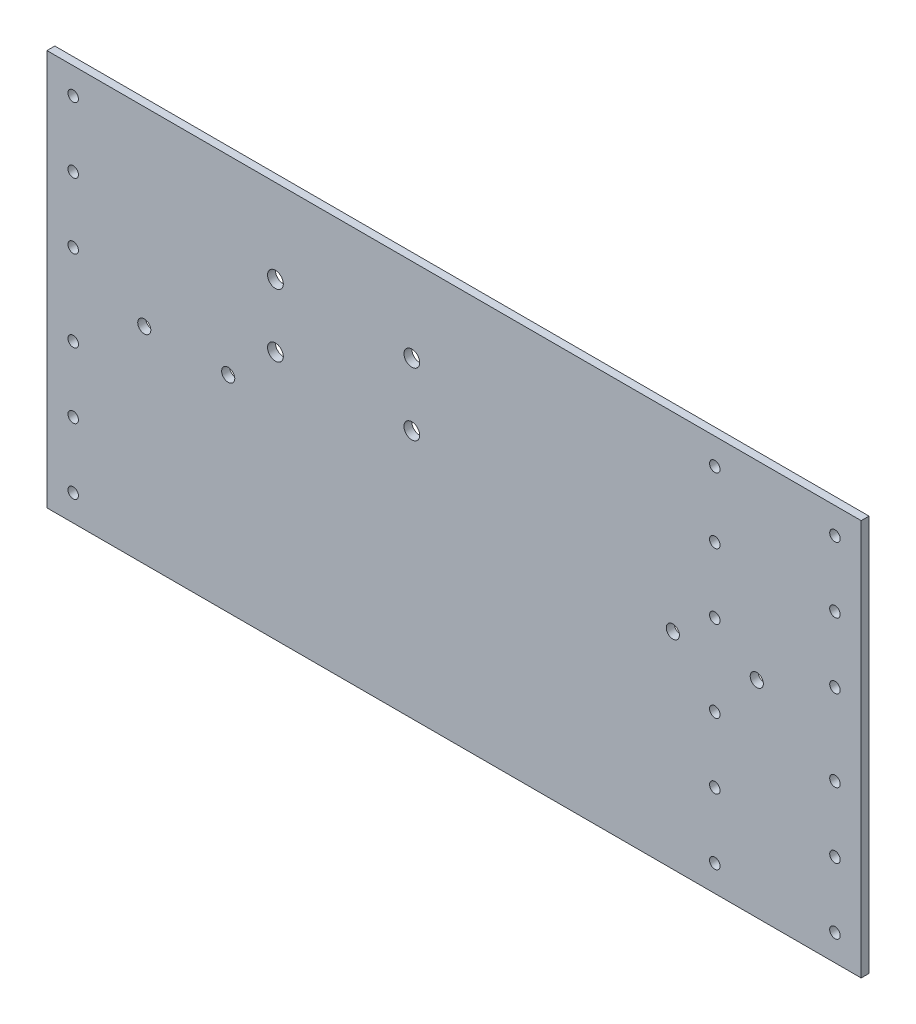
ISO-10303-21;
HEADER;
FILE_DESCRIPTION(('STEP AP214'),'2;1');
FILE_NAME('part.step','',(''),(''),'','','');
FILE_SCHEMA(('AUTOMOTIVE_DESIGN { 1 0 10303 214 1 1 1 1 }'));
ENDSEC;
DATA;
#1=APPLICATION_CONTEXT('core data for automotive mechanical design processes');
#2=APPLICATION_PROTOCOL_DEFINITION('international standard','automotive_design',2000,#1);
#3=PRODUCT_CONTEXT('',#1,'mechanical');
#4=PRODUCT('Part','Part','',(#3));
#5=PRODUCT_RELATED_PRODUCT_CATEGORY('part','',(#4));
#6=PRODUCT_DEFINITION_FORMATION('','',#4);
#7=PRODUCT_DEFINITION_CONTEXT('part definition',#1,'design');
#8=PRODUCT_DEFINITION('design','',#6,#7);
#9=PRODUCT_DEFINITION_SHAPE('','',#8);
#10=(LENGTH_UNIT() NAMED_UNIT(*) SI_UNIT(.MILLI.,.METRE.));
#11=(NAMED_UNIT(*) PLANE_ANGLE_UNIT() SI_UNIT($,.RADIAN.));
#12=(NAMED_UNIT(*) SI_UNIT($,.STERADIAN.) SOLID_ANGLE_UNIT());
#13=UNCERTAINTY_MEASURE_WITH_UNIT(LENGTH_MEASURE(1.E-05),#10,'distance_accuracy_value','');
#14=(GEOMETRIC_REPRESENTATION_CONTEXT(3) GLOBAL_UNCERTAINTY_ASSIGNED_CONTEXT((#13)) GLOBAL_UNIT_ASSIGNED_CONTEXT((#10,
#11,#12)) REPRESENTATION_CONTEXT('',''));
#15=CARTESIAN_POINT('',(0.,0.,0.));
#16=DIRECTION('',(0.,0.,1.));
#17=DIRECTION('',(1.,0.,0.));
#18=AXIS2_PLACEMENT_3D('',#15,#16,#17);
#19=CARTESIAN_POINT('',(0.,0.,3.));
#20=DIRECTION('',(1.,0.,0.));
#21=DIRECTION('',(0.,0.,-1.));
#22=AXIS2_PLACEMENT_3D('',#19,#20,#21);
#23=PLANE('',#22);
#24=DIRECTION('',(0.,-1.,0.));
#25=VECTOR('',#24,1.);
#26=CARTESIAN_POINT('',(0.,0.,0.));
#27=LINE('',#26,#25);
#28=CARTESIAN_POINT('',(0.,151.,0.));
#29=VERTEX_POINT('',#28);
#30=CARTESIAN_POINT('',(0.,0.,0.));
#31=VERTEX_POINT('',#30);
#32=EDGE_CURVE('E95',#29,#31,#27,.T.);
#33=ORIENTED_EDGE('',*,*,#32,.T.);
#34=DIRECTION('',(0.,0.,-1.));
#35=VECTOR('',#34,1.);
#36=CARTESIAN_POINT('',(0.,0.,3.));
#37=LINE('',#36,#35);
#38=CARTESIAN_POINT('',(0.,0.,3.));
#39=VERTEX_POINT('',#38);
#40=EDGE_CURVE('E11',#39,#31,#37,.T.);
#41=ORIENTED_EDGE('',*,*,#40,.F.);
#42=DIRECTION('',(0.,-1.,0.));
#43=VECTOR('',#42,1.);
#44=CARTESIAN_POINT('',(0.,0.,3.));
#45=LINE('',#44,#43);
#46=CARTESIAN_POINT('',(0.,151.,3.));
#47=VERTEX_POINT('',#46);
#48=EDGE_CURVE('E83',#47,#39,#45,.T.);
#49=ORIENTED_EDGE('',*,*,#48,.F.);
#50=DIRECTION('',(0.,0.,-1.));
#51=VECTOR('',#50,1.);
#52=CARTESIAN_POINT('',(0.,151.,3.));
#53=LINE('',#52,#51);
#54=EDGE_CURVE('E91',#47,#29,#53,.T.);
#55=ORIENTED_EDGE('',*,*,#54,.T.);
#56=EDGE_LOOP('',(#33,#41,#49,#55));
#57=FACE_BOUND('',#56,.T.);
#58=ADVANCED_FACE('F32',(#57),#23,.F.);
#59=CARTESIAN_POINT('',(0.,0.,3.));
#60=DIRECTION('',(0.,1.,0.));
#61=DIRECTION('',(0.,0.,1.));
#62=AXIS2_PLACEMENT_3D('',#59,#60,#61);
#63=PLANE('',#62);
#64=DIRECTION('',(1.,0.,0.));
#65=VECTOR('',#64,1.);
#66=CARTESIAN_POINT('',(0.,0.,0.));
#67=LINE('',#66,#65);
#68=CARTESIAN_POINT('',(310.4,0.,0.));
#69=VERTEX_POINT('',#68);
#70=EDGE_CURVE('E87',#31,#69,#67,.T.);
#71=ORIENTED_EDGE('',*,*,#70,.T.);
#72=DIRECTION('',(0.,0.,-1.));
#73=VECTOR('',#72,1.);
#74=CARTESIAN_POINT('',(310.4,0.,3.));
#75=LINE('',#74,#73);
#76=CARTESIAN_POINT('',(310.4,0.,3.));
#77=VERTEX_POINT('',#76);
#78=EDGE_CURVE('E40',#77,#69,#75,.T.);
#79=ORIENTED_EDGE('',*,*,#78,.F.);
#80=DIRECTION('',(1.,0.,0.));
#81=VECTOR('',#80,1.);
#82=CARTESIAN_POINT('',(0.,0.,3.));
#83=LINE('',#82,#81);
#84=EDGE_CURVE('E78',#39,#77,#83,.T.);
#85=ORIENTED_EDGE('',*,*,#84,.F.);
#86=ORIENTED_EDGE('',*,*,#40,.T.);
#87=EDGE_LOOP('',(#71,#79,#85,#86));
#88=FACE_BOUND('',#87,.T.);
#89=ADVANCED_FACE('F86',(#88),#63,.F.);
#90=CARTESIAN_POINT('',(310.4,0.,3.));
#91=DIRECTION('',(-1.,0.,0.));
#92=DIRECTION('',(0.,-1.,0.));
#93=AXIS2_PLACEMENT_3D('',#90,#91,#92);
#94=PLANE('',#93);
#95=DIRECTION('',(0.,1.,0.));
#96=VECTOR('',#95,1.);
#97=CARTESIAN_POINT('',(310.4,0.,0.));
#98=LINE('',#97,#96);
#99=CARTESIAN_POINT('',(310.4,151.,0.));
#100=VERTEX_POINT('',#99);
#101=EDGE_CURVE('E65',#69,#100,#98,.T.);
#102=ORIENTED_EDGE('',*,*,#101,.T.);
#103=DIRECTION('',(0.,0.,-1.));
#104=VECTOR('',#103,1.);
#105=CARTESIAN_POINT('',(310.4,151.,3.));
#106=LINE('',#105,#104);
#107=CARTESIAN_POINT('',(310.4,151.,3.));
#108=VERTEX_POINT('',#107);
#109=EDGE_CURVE('E88',#108,#100,#106,.T.);
#110=ORIENTED_EDGE('',*,*,#109,.F.);
#111=DIRECTION('',(0.,1.,0.));
#112=VECTOR('',#111,1.);
#113=CARTESIAN_POINT('',(310.4,0.,3.));
#114=LINE('',#113,#112);
#115=EDGE_CURVE('E81',#77,#108,#114,.T.);
#116=ORIENTED_EDGE('',*,*,#115,.F.);
#117=ORIENTED_EDGE('',*,*,#78,.T.);
#118=EDGE_LOOP('',(#102,#110,#116,#117));
#119=FACE_BOUND('',#118,.T.);
#120=ADVANCED_FACE('F89',(#119),#94,.F.);
#121=CARTESIAN_POINT('',(0.,151.,3.));
#122=DIRECTION('',(0.,-1.,0.));
#123=DIRECTION('',(0.,0.,-1.));
#124=AXIS2_PLACEMENT_3D('',#121,#122,#123);
#125=PLANE('',#124);
#126=DIRECTION('',(-1.,0.,0.));
#127=VECTOR('',#126,1.);
#128=CARTESIAN_POINT('',(0.,151.,0.));
#129=LINE('',#128,#127);
#130=EDGE_CURVE('E71',#100,#29,#129,.T.);
#131=ORIENTED_EDGE('',*,*,#130,.T.);
#132=ORIENTED_EDGE('',*,*,#54,.F.);
#133=DIRECTION('',(-1.,0.,0.));
#134=VECTOR('',#133,1.);
#135=CARTESIAN_POINT('',(0.,151.,3.));
#136=LINE('',#135,#134);
#137=EDGE_CURVE('E48',#108,#47,#136,.T.);
#138=ORIENTED_EDGE('',*,*,#137,.F.);
#139=ORIENTED_EDGE('',*,*,#109,.T.);
#140=EDGE_LOOP('',(#131,#132,#138,#139));
#141=FACE_BOUND('',#140,.T.);
#142=ADVANCED_FACE('F103',(#141),#125,.F.);
#143=CARTESIAN_POINT('',(0.,0.,3.));
#144=DIRECTION('',(0.,0.,-1.));
#145=DIRECTION('',(-1.,0.,0.));
#146=AXIS2_PLACEMENT_3D('',#143,#144,#145);
#147=PLANE('',#146);
#148=CARTESIAN_POINT('',(37.1,78.5,3.));
#149=DIRECTION('',(0.,0.,-1.));
#150=DIRECTION('',(-1.,0.,0.));
#151=AXIS2_PLACEMENT_3D('',#148,#149,#150);
#152=CIRCLE('',#151,2.5);
#153=CARTESIAN_POINT('',(34.6,78.5,3.));
#154=VERTEX_POINT('',#153);
#155=EDGE_CURVE('E258',#154,#154,#152,.T.);
#156=ORIENTED_EDGE('',*,*,#155,.T.);
#157=EDGE_LOOP('',(#156));
#158=FACE_BOUND('',#157,.T.);
#159=CARTESIAN_POINT('',(69.1,78.5,3.));
#160=DIRECTION('',(0.,0.,-1.));
#161=DIRECTION('',(-1.,0.,0.));
#162=AXIS2_PLACEMENT_3D('',#159,#160,#161);
#163=CIRCLE('',#162,2.50000000000001);
#164=CARTESIAN_POINT('',(66.6,78.5,3.));
#165=VERTEX_POINT('',#164);
#166=EDGE_CURVE('E252',#165,#165,#163,.T.);
#167=ORIENTED_EDGE('',*,*,#166,.T.);
#168=EDGE_LOOP('',(#167));
#169=FACE_BOUND('',#168,.T.);
#170=CARTESIAN_POINT('',(238.6,78.5,3.));
#171=DIRECTION('',(0.,0.,-1.));
#172=DIRECTION('',(-1.,0.,0.));
#173=AXIS2_PLACEMENT_3D('',#170,#171,#172);
#174=CIRCLE('',#173,2.5);
#175=CARTESIAN_POINT('',(236.1,78.5,3.));
#176=VERTEX_POINT('',#175);
#177=EDGE_CURVE('E246',#176,#176,#174,.T.);
#178=ORIENTED_EDGE('',*,*,#177,.T.);
#179=EDGE_LOOP('',(#178));
#180=FACE_BOUND('',#179,.T.);
#181=CARTESIAN_POINT('',(270.6,78.5,3.));
#182=DIRECTION('',(0.,0.,-1.));
#183=DIRECTION('',(-1.,0.,0.));
#184=AXIS2_PLACEMENT_3D('',#181,#182,#183);
#185=CIRCLE('',#184,2.50000000000002);
#186=CARTESIAN_POINT('',(268.1,78.5,3.));
#187=VERTEX_POINT('',#186);
#188=EDGE_CURVE('E240',#187,#187,#185,.T.);
#189=ORIENTED_EDGE('',*,*,#188,.T.);
#190=EDGE_LOOP('',(#189));
#191=FACE_BOUND('',#190,.T.);
#192=CARTESIAN_POINT('',(87.1,95.,3.));
#193=DIRECTION('',(0.,0.,-1.));
#194=DIRECTION('',(-1.,0.,0.));
#195=AXIS2_PLACEMENT_3D('',#192,#193,#194);
#196=CIRCLE('',#195,2.99999999999999);
#197=CARTESIAN_POINT('',(84.1,95.,3.));
#198=VERTEX_POINT('',#197);
#199=EDGE_CURVE('E234',#198,#198,#196,.T.);
#200=ORIENTED_EDGE('',*,*,#199,.T.);
#201=EDGE_LOOP('',(#200));
#202=FACE_BOUND('',#201,.T.);
#203=CARTESIAN_POINT('',(139.1,95.,3.));
#204=DIRECTION('',(0.,0.,-1.));
#205=DIRECTION('',(-1.,0.,0.));
#206=AXIS2_PLACEMENT_3D('',#203,#204,#205);
#207=CIRCLE('',#206,2.99999999999999);
#208=CARTESIAN_POINT('',(136.1,95.,3.));
#209=VERTEX_POINT('',#208);
#210=EDGE_CURVE('E228',#209,#209,#207,.T.);
#211=ORIENTED_EDGE('',*,*,#210,.T.);
#212=EDGE_LOOP('',(#211));
#213=FACE_BOUND('',#212,.T.);
#214=CARTESIAN_POINT('',(87.1,119.,3.));
#215=DIRECTION('',(0.,0.,-1.));
#216=DIRECTION('',(-1.,0.,0.));
#217=AXIS2_PLACEMENT_3D('',#214,#215,#216);
#218=CIRCLE('',#217,2.99999999999999);
#219=CARTESIAN_POINT('',(84.1,119.,3.));
#220=VERTEX_POINT('',#219);
#221=EDGE_CURVE('E222',#220,#220,#218,.T.);
#222=ORIENTED_EDGE('',*,*,#221,.T.);
#223=EDGE_LOOP('',(#222));
#224=FACE_BOUND('',#223,.T.);
#225=CARTESIAN_POINT('',(139.1,119.,3.));
#226=DIRECTION('',(0.,0.,-1.));
#227=DIRECTION('',(-1.,0.,0.));
#228=AXIS2_PLACEMENT_3D('',#225,#226,#227);
#229=CIRCLE('',#228,2.99999999999999);
#230=CARTESIAN_POINT('',(136.1,119.,3.));
#231=VERTEX_POINT('',#230);
#232=EDGE_CURVE('E216',#231,#231,#229,.T.);
#233=ORIENTED_EDGE('',*,*,#232,.T.);
#234=EDGE_LOOP('',(#233));
#235=FACE_BOUND('',#234,.T.);
#236=CARTESIAN_POINT('',(254.6,141.,3.));
#237=DIRECTION('',(0.,0.,-1.));
#238=DIRECTION('',(-1.,0.,0.));
#239=AXIS2_PLACEMENT_3D('',#236,#237,#238);
#240=CIRCLE('',#239,2.);
#241=CARTESIAN_POINT('',(252.6,141.,3.));
#242=VERTEX_POINT('',#241);
#243=EDGE_CURVE('E210',#242,#242,#240,.T.);
#244=ORIENTED_EDGE('',*,*,#243,.T.);
#245=EDGE_LOOP('',(#244));
#246=FACE_BOUND('',#245,.T.);
#247=CARTESIAN_POINT('',(254.6,116.,3.));
#248=DIRECTION('',(0.,0.,-1.));
#249=DIRECTION('',(-1.,0.,0.));
#250=AXIS2_PLACEMENT_3D('',#247,#248,#249);
#251=CIRCLE('',#250,2.);
#252=CARTESIAN_POINT('',(252.6,116.,3.));
#253=VERTEX_POINT('',#252);
#254=EDGE_CURVE('E204',#253,#253,#251,.T.);
#255=ORIENTED_EDGE('',*,*,#254,.T.);
#256=EDGE_LOOP('',(#255));
#257=FACE_BOUND('',#256,.T.);
#258=CARTESIAN_POINT('',(254.6,91.,3.));
#259=DIRECTION('',(0.,0.,-1.));
#260=DIRECTION('',(-1.,0.,0.));
#261=AXIS2_PLACEMENT_3D('',#258,#259,#260);
#262=CIRCLE('',#261,2.);
#263=CARTESIAN_POINT('',(252.6,91.,3.));
#264=VERTEX_POINT('',#263);
#265=EDGE_CURVE('E198',#264,#264,#262,.T.);
#266=ORIENTED_EDGE('',*,*,#265,.T.);
#267=EDGE_LOOP('',(#266));
#268=FACE_BOUND('',#267,.T.);
#269=CARTESIAN_POINT('',(254.6,60.,3.));
#270=DIRECTION('',(0.,0.,-1.));
#271=DIRECTION('',(-1.,0.,0.));
#272=AXIS2_PLACEMENT_3D('',#269,#270,#271);
#273=CIRCLE('',#272,2.);
#274=CARTESIAN_POINT('',(252.6,60.,3.));
#275=VERTEX_POINT('',#274);
#276=EDGE_CURVE('E192',#275,#275,#273,.T.);
#277=ORIENTED_EDGE('',*,*,#276,.T.);
#278=EDGE_LOOP('',(#277));
#279=FACE_BOUND('',#278,.T.);
#280=CARTESIAN_POINT('',(254.6,35.,3.));
#281=DIRECTION('',(0.,0.,-1.));
#282=DIRECTION('',(-1.,0.,0.));
#283=AXIS2_PLACEMENT_3D('',#280,#281,#282);
#284=CIRCLE('',#283,2.);
#285=CARTESIAN_POINT('',(252.6,35.,3.));
#286=VERTEX_POINT('',#285);
#287=EDGE_CURVE('E186',#286,#286,#284,.T.);
#288=ORIENTED_EDGE('',*,*,#287,.T.);
#289=EDGE_LOOP('',(#288));
#290=FACE_BOUND('',#289,.T.);
#291=CARTESIAN_POINT('',(254.6,10.,3.));
#292=DIRECTION('',(0.,0.,-1.));
#293=DIRECTION('',(-1.,0.,0.));
#294=AXIS2_PLACEMENT_3D('',#291,#292,#293);
#295=CIRCLE('',#294,2.);
#296=CARTESIAN_POINT('',(252.6,10.,3.));
#297=VERTEX_POINT('',#296);
#298=EDGE_CURVE('E180',#297,#297,#295,.T.);
#299=ORIENTED_EDGE('',*,*,#298,.T.);
#300=EDGE_LOOP('',(#299));
#301=FACE_BOUND('',#300,.T.);
#302=CARTESIAN_POINT('',(10.,10.,3.));
#303=DIRECTION('',(0.,0.,-1.));
#304=DIRECTION('',(-1.,0.,0.));
#305=AXIS2_PLACEMENT_3D('',#302,#303,#304);
#306=CIRCLE('',#305,2.);
#307=CARTESIAN_POINT('',(8.,10.,3.));
#308=VERTEX_POINT('',#307);
#309=EDGE_CURVE('E174',#308,#308,#306,.T.);
#310=ORIENTED_EDGE('',*,*,#309,.T.);
#311=EDGE_LOOP('',(#310));
#312=FACE_BOUND('',#311,.T.);
#313=CARTESIAN_POINT('',(10.,35.,3.));
#314=DIRECTION('',(0.,0.,-1.));
#315=DIRECTION('',(-1.,0.,0.));
#316=AXIS2_PLACEMENT_3D('',#313,#314,#315);
#317=CIRCLE('',#316,2.);
#318=CARTESIAN_POINT('',(8.,35.,3.));
#319=VERTEX_POINT('',#318);
#320=EDGE_CURVE('E168',#319,#319,#317,.T.);
#321=ORIENTED_EDGE('',*,*,#320,.T.);
#322=EDGE_LOOP('',(#321));
#323=FACE_BOUND('',#322,.T.);
#324=CARTESIAN_POINT('',(10.,60.,3.));
#325=DIRECTION('',(0.,0.,-1.));
#326=DIRECTION('',(-1.,0.,0.));
#327=AXIS2_PLACEMENT_3D('',#324,#325,#326);
#328=CIRCLE('',#327,2.);
#329=CARTESIAN_POINT('',(8.,60.,3.));
#330=VERTEX_POINT('',#329);
#331=EDGE_CURVE('E162',#330,#330,#328,.T.);
#332=ORIENTED_EDGE('',*,*,#331,.T.);
#333=EDGE_LOOP('',(#332));
#334=FACE_BOUND('',#333,.T.);
#335=CARTESIAN_POINT('',(10.,91.,3.));
#336=DIRECTION('',(0.,0.,-1.));
#337=DIRECTION('',(-1.,0.,0.));
#338=AXIS2_PLACEMENT_3D('',#335,#336,#337);
#339=CIRCLE('',#338,2.);
#340=CARTESIAN_POINT('',(8.00000000000001,91.,3.));
#341=VERTEX_POINT('',#340);
#342=EDGE_CURVE('E156',#341,#341,#339,.T.);
#343=ORIENTED_EDGE('',*,*,#342,.T.);
#344=EDGE_LOOP('',(#343));
#345=FACE_BOUND('',#344,.T.);
#346=CARTESIAN_POINT('',(10.,116.,3.));
#347=DIRECTION('',(0.,0.,-1.));
#348=DIRECTION('',(-1.,0.,0.));
#349=AXIS2_PLACEMENT_3D('',#346,#347,#348);
#350=CIRCLE('',#349,2.);
#351=CARTESIAN_POINT('',(8.00000000000001,116.,3.));
#352=VERTEX_POINT('',#351);
#353=EDGE_CURVE('E150',#352,#352,#350,.T.);
#354=ORIENTED_EDGE('',*,*,#353,.T.);
#355=EDGE_LOOP('',(#354));
#356=FACE_BOUND('',#355,.T.);
#357=CARTESIAN_POINT('',(10.,141.,3.));
#358=DIRECTION('',(0.,0.,-1.));
#359=DIRECTION('',(-1.,0.,0.));
#360=AXIS2_PLACEMENT_3D('',#357,#358,#359);
#361=CIRCLE('',#360,2.);
#362=CARTESIAN_POINT('',(8.,141.,3.));
#363=VERTEX_POINT('',#362);
#364=EDGE_CURVE('E144',#363,#363,#361,.T.);
#365=ORIENTED_EDGE('',*,*,#364,.T.);
#366=EDGE_LOOP('',(#365));
#367=FACE_BOUND('',#366,.T.);
#368=CARTESIAN_POINT('',(300.4,60.,3.));
#369=DIRECTION('',(0.,0.,-1.));
#370=DIRECTION('',(-1.,0.,0.));
#371=AXIS2_PLACEMENT_3D('',#368,#369,#370);
#372=CIRCLE('',#371,2.);
#373=CARTESIAN_POINT('',(298.4,60.,3.));
#374=VERTEX_POINT('',#373);
#375=EDGE_CURVE('E138',#374,#374,#372,.T.);
#376=ORIENTED_EDGE('',*,*,#375,.T.);
#377=EDGE_LOOP('',(#376));
#378=FACE_BOUND('',#377,.T.);
#379=CARTESIAN_POINT('',(300.4,10.,3.));
#380=DIRECTION('',(0.,0.,-1.));
#381=DIRECTION('',(-1.,0.,0.));
#382=AXIS2_PLACEMENT_3D('',#379,#380,#381);
#383=CIRCLE('',#382,2.);
#384=CARTESIAN_POINT('',(298.4,10.,3.));
#385=VERTEX_POINT('',#384);
#386=EDGE_CURVE('E132',#385,#385,#383,.T.);
#387=ORIENTED_EDGE('',*,*,#386,.T.);
#388=EDGE_LOOP('',(#387));
#389=FACE_BOUND('',#388,.T.);
#390=CARTESIAN_POINT('',(300.4,35.,3.));
#391=DIRECTION('',(0.,0.,-1.));
#392=DIRECTION('',(-1.,0.,0.));
#393=AXIS2_PLACEMENT_3D('',#390,#391,#392);
#394=CIRCLE('',#393,2.);
#395=CARTESIAN_POINT('',(298.4,35.,3.));
#396=VERTEX_POINT('',#395);
#397=EDGE_CURVE('E126',#396,#396,#394,.T.);
#398=ORIENTED_EDGE('',*,*,#397,.T.);
#399=EDGE_LOOP('',(#398));
#400=FACE_BOUND('',#399,.T.);
#401=CARTESIAN_POINT('',(300.4,91.,3.));
#402=DIRECTION('',(0.,0.,-1.));
#403=DIRECTION('',(-1.,0.,0.));
#404=AXIS2_PLACEMENT_3D('',#401,#402,#403);
#405=CIRCLE('',#404,2.);
#406=CARTESIAN_POINT('',(298.4,91.,3.));
#407=VERTEX_POINT('',#406);
#408=EDGE_CURVE('E120',#407,#407,#405,.T.);
#409=ORIENTED_EDGE('',*,*,#408,.T.);
#410=EDGE_LOOP('',(#409));
#411=FACE_BOUND('',#410,.T.);
#412=CARTESIAN_POINT('',(300.4,116.,3.));
#413=DIRECTION('',(0.,0.,-1.));
#414=DIRECTION('',(-1.,0.,0.));
#415=AXIS2_PLACEMENT_3D('',#412,#413,#414);
#416=CIRCLE('',#415,2.);
#417=CARTESIAN_POINT('',(298.4,116.,3.));
#418=VERTEX_POINT('',#417);
#419=EDGE_CURVE('E114',#418,#418,#416,.T.);
#420=ORIENTED_EDGE('',*,*,#419,.T.);
#421=EDGE_LOOP('',(#420));
#422=FACE_BOUND('',#421,.T.);
#423=CARTESIAN_POINT('',(300.4,141.,3.));
#424=DIRECTION('',(0.,0.,-1.));
#425=DIRECTION('',(-1.,0.,0.));
#426=AXIS2_PLACEMENT_3D('',#423,#424,#425);
#427=CIRCLE('',#426,2.);
#428=CARTESIAN_POINT('',(298.4,141.,3.));
#429=VERTEX_POINT('',#428);
#430=EDGE_CURVE('E98',#429,#429,#427,.T.);
#431=ORIENTED_EDGE('',*,*,#430,.T.);
#432=EDGE_LOOP('',(#431));
#433=FACE_BOUND('',#432,.T.);
#434=ORIENTED_EDGE('',*,*,#48,.T.);
#435=ORIENTED_EDGE('',*,*,#84,.T.);
#436=ORIENTED_EDGE('',*,*,#115,.T.);
#437=ORIENTED_EDGE('',*,*,#137,.T.);
#438=EDGE_LOOP('',(#434,#435,#436,#437));
#439=FACE_BOUND('',#438,.T.);
#440=ADVANCED_FACE('F79',(#158,#169,#180,#191,#202,#213,#224,#235,#246,#257,#268,#279,#290,#301,
#312,#323,#334,#345,#356,#367,#378,#389,#400,#411,#422,#433,#439),#147,.F.);
#441=CARTESIAN_POINT('',(0.,0.,0.));
#442=DIRECTION('',(0.,0.,-1.));
#443=DIRECTION('',(-1.,0.,0.));
#444=AXIS2_PLACEMENT_3D('',#441,#442,#443);
#445=PLANE('',#444);
#446=CARTESIAN_POINT('',(37.1,78.5,0.));
#447=DIRECTION('',(0.,0.,-1.));
#448=DIRECTION('',(-1.,0.,0.));
#449=AXIS2_PLACEMENT_3D('',#446,#447,#448);
#450=CIRCLE('',#449,2.5);
#451=CARTESIAN_POINT('',(34.6,78.5,0.));
#452=VERTEX_POINT('',#451);
#453=EDGE_CURVE('E261',#452,#452,#450,.T.);
#454=ORIENTED_EDGE('',*,*,#453,.F.);
#455=EDGE_LOOP('',(#454));
#456=FACE_BOUND('',#455,.T.);
#457=CARTESIAN_POINT('',(69.1,78.5,0.));
#458=DIRECTION('',(0.,0.,-1.));
#459=DIRECTION('',(-1.,0.,0.));
#460=AXIS2_PLACEMENT_3D('',#457,#458,#459);
#461=CIRCLE('',#460,2.50000000000001);
#462=CARTESIAN_POINT('',(66.6,78.5,0.));
#463=VERTEX_POINT('',#462);
#464=EDGE_CURVE('E255',#463,#463,#461,.T.);
#465=ORIENTED_EDGE('',*,*,#464,.F.);
#466=EDGE_LOOP('',(#465));
#467=FACE_BOUND('',#466,.T.);
#468=CARTESIAN_POINT('',(238.6,78.5,0.));
#469=DIRECTION('',(0.,0.,-1.));
#470=DIRECTION('',(-1.,0.,0.));
#471=AXIS2_PLACEMENT_3D('',#468,#469,#470);
#472=CIRCLE('',#471,2.5);
#473=CARTESIAN_POINT('',(236.1,78.5,0.));
#474=VERTEX_POINT('',#473);
#475=EDGE_CURVE('E249',#474,#474,#472,.T.);
#476=ORIENTED_EDGE('',*,*,#475,.F.);
#477=EDGE_LOOP('',(#476));
#478=FACE_BOUND('',#477,.T.);
#479=CARTESIAN_POINT('',(270.6,78.5,0.));
#480=DIRECTION('',(0.,0.,-1.));
#481=DIRECTION('',(-1.,0.,0.));
#482=AXIS2_PLACEMENT_3D('',#479,#480,#481);
#483=CIRCLE('',#482,2.50000000000002);
#484=CARTESIAN_POINT('',(268.1,78.5,0.));
#485=VERTEX_POINT('',#484);
#486=EDGE_CURVE('E243',#485,#485,#483,.T.);
#487=ORIENTED_EDGE('',*,*,#486,.F.);
#488=EDGE_LOOP('',(#487));
#489=FACE_BOUND('',#488,.T.);
#490=CARTESIAN_POINT('',(87.1,95.,0.));
#491=DIRECTION('',(0.,0.,-1.));
#492=DIRECTION('',(-1.,0.,0.));
#493=AXIS2_PLACEMENT_3D('',#490,#491,#492);
#494=CIRCLE('',#493,2.99999999999999);
#495=CARTESIAN_POINT('',(84.1,95.,0.));
#496=VERTEX_POINT('',#495);
#497=EDGE_CURVE('E237',#496,#496,#494,.T.);
#498=ORIENTED_EDGE('',*,*,#497,.F.);
#499=EDGE_LOOP('',(#498));
#500=FACE_BOUND('',#499,.T.);
#501=CARTESIAN_POINT('',(139.1,95.,0.));
#502=DIRECTION('',(0.,0.,-1.));
#503=DIRECTION('',(-1.,0.,0.));
#504=AXIS2_PLACEMENT_3D('',#501,#502,#503);
#505=CIRCLE('',#504,2.99999999999999);
#506=CARTESIAN_POINT('',(136.1,95.,0.));
#507=VERTEX_POINT('',#506);
#508=EDGE_CURVE('E231',#507,#507,#505,.T.);
#509=ORIENTED_EDGE('',*,*,#508,.F.);
#510=EDGE_LOOP('',(#509));
#511=FACE_BOUND('',#510,.T.);
#512=CARTESIAN_POINT('',(87.1,119.,0.));
#513=DIRECTION('',(0.,0.,-1.));
#514=DIRECTION('',(-1.,0.,0.));
#515=AXIS2_PLACEMENT_3D('',#512,#513,#514);
#516=CIRCLE('',#515,2.99999999999999);
#517=CARTESIAN_POINT('',(84.1,119.,0.));
#518=VERTEX_POINT('',#517);
#519=EDGE_CURVE('E225',#518,#518,#516,.T.);
#520=ORIENTED_EDGE('',*,*,#519,.F.);
#521=EDGE_LOOP('',(#520));
#522=FACE_BOUND('',#521,.T.);
#523=CARTESIAN_POINT('',(139.1,119.,0.));
#524=DIRECTION('',(0.,0.,-1.));
#525=DIRECTION('',(-1.,0.,0.));
#526=AXIS2_PLACEMENT_3D('',#523,#524,#525);
#527=CIRCLE('',#526,2.99999999999999);
#528=CARTESIAN_POINT('',(136.1,119.,0.));
#529=VERTEX_POINT('',#528);
#530=EDGE_CURVE('E219',#529,#529,#527,.T.);
#531=ORIENTED_EDGE('',*,*,#530,.F.);
#532=EDGE_LOOP('',(#531));
#533=FACE_BOUND('',#532,.T.);
#534=CARTESIAN_POINT('',(254.6,141.,0.));
#535=DIRECTION('',(0.,0.,-1.));
#536=DIRECTION('',(-1.,0.,0.));
#537=AXIS2_PLACEMENT_3D('',#534,#535,#536);
#538=CIRCLE('',#537,2.);
#539=CARTESIAN_POINT('',(252.6,141.,0.));
#540=VERTEX_POINT('',#539);
#541=EDGE_CURVE('E213',#540,#540,#538,.T.);
#542=ORIENTED_EDGE('',*,*,#541,.F.);
#543=EDGE_LOOP('',(#542));
#544=FACE_BOUND('',#543,.T.);
#545=CARTESIAN_POINT('',(254.6,116.,0.));
#546=DIRECTION('',(0.,0.,-1.));
#547=DIRECTION('',(-1.,0.,0.));
#548=AXIS2_PLACEMENT_3D('',#545,#546,#547);
#549=CIRCLE('',#548,2.);
#550=CARTESIAN_POINT('',(252.6,116.,0.));
#551=VERTEX_POINT('',#550);
#552=EDGE_CURVE('E207',#551,#551,#549,.T.);
#553=ORIENTED_EDGE('',*,*,#552,.F.);
#554=EDGE_LOOP('',(#553));
#555=FACE_BOUND('',#554,.T.);
#556=CARTESIAN_POINT('',(254.6,91.,0.));
#557=DIRECTION('',(0.,0.,-1.));
#558=DIRECTION('',(-1.,0.,0.));
#559=AXIS2_PLACEMENT_3D('',#556,#557,#558);
#560=CIRCLE('',#559,2.);
#561=CARTESIAN_POINT('',(252.6,91.,0.));
#562=VERTEX_POINT('',#561);
#563=EDGE_CURVE('E201',#562,#562,#560,.T.);
#564=ORIENTED_EDGE('',*,*,#563,.F.);
#565=EDGE_LOOP('',(#564));
#566=FACE_BOUND('',#565,.T.);
#567=CARTESIAN_POINT('',(254.6,60.,0.));
#568=DIRECTION('',(0.,0.,-1.));
#569=DIRECTION('',(-1.,0.,0.));
#570=AXIS2_PLACEMENT_3D('',#567,#568,#569);
#571=CIRCLE('',#570,2.);
#572=CARTESIAN_POINT('',(252.6,60.,0.));
#573=VERTEX_POINT('',#572);
#574=EDGE_CURVE('E195',#573,#573,#571,.T.);
#575=ORIENTED_EDGE('',*,*,#574,.F.);
#576=EDGE_LOOP('',(#575));
#577=FACE_BOUND('',#576,.T.);
#578=CARTESIAN_POINT('',(254.6,35.,0.));
#579=DIRECTION('',(0.,0.,-1.));
#580=DIRECTION('',(-1.,0.,0.));
#581=AXIS2_PLACEMENT_3D('',#578,#579,#580);
#582=CIRCLE('',#581,2.);
#583=CARTESIAN_POINT('',(252.6,35.,0.));
#584=VERTEX_POINT('',#583);
#585=EDGE_CURVE('E189',#584,#584,#582,.T.);
#586=ORIENTED_EDGE('',*,*,#585,.F.);
#587=EDGE_LOOP('',(#586));
#588=FACE_BOUND('',#587,.T.);
#589=CARTESIAN_POINT('',(254.6,10.,0.));
#590=DIRECTION('',(0.,0.,-1.));
#591=DIRECTION('',(-1.,0.,0.));
#592=AXIS2_PLACEMENT_3D('',#589,#590,#591);
#593=CIRCLE('',#592,2.);
#594=CARTESIAN_POINT('',(252.6,10.,0.));
#595=VERTEX_POINT('',#594);
#596=EDGE_CURVE('E183',#595,#595,#593,.T.);
#597=ORIENTED_EDGE('',*,*,#596,.F.);
#598=EDGE_LOOP('',(#597));
#599=FACE_BOUND('',#598,.T.);
#600=CARTESIAN_POINT('',(10.,10.,0.));
#601=DIRECTION('',(0.,0.,-1.));
#602=DIRECTION('',(-1.,0.,0.));
#603=AXIS2_PLACEMENT_3D('',#600,#601,#602);
#604=CIRCLE('',#603,2.);
#605=CARTESIAN_POINT('',(8.,10.,0.));
#606=VERTEX_POINT('',#605);
#607=EDGE_CURVE('E177',#606,#606,#604,.T.);
#608=ORIENTED_EDGE('',*,*,#607,.F.);
#609=EDGE_LOOP('',(#608));
#610=FACE_BOUND('',#609,.T.);
#611=CARTESIAN_POINT('',(10.,35.,0.));
#612=DIRECTION('',(0.,0.,-1.));
#613=DIRECTION('',(-1.,0.,0.));
#614=AXIS2_PLACEMENT_3D('',#611,#612,#613);
#615=CIRCLE('',#614,2.);
#616=CARTESIAN_POINT('',(8.,35.,0.));
#617=VERTEX_POINT('',#616);
#618=EDGE_CURVE('E171',#617,#617,#615,.T.);
#619=ORIENTED_EDGE('',*,*,#618,.F.);
#620=EDGE_LOOP('',(#619));
#621=FACE_BOUND('',#620,.T.);
#622=CARTESIAN_POINT('',(10.,60.,0.));
#623=DIRECTION('',(0.,0.,-1.));
#624=DIRECTION('',(-1.,0.,0.));
#625=AXIS2_PLACEMENT_3D('',#622,#623,#624);
#626=CIRCLE('',#625,2.);
#627=CARTESIAN_POINT('',(8.,60.,0.));
#628=VERTEX_POINT('',#627);
#629=EDGE_CURVE('E165',#628,#628,#626,.T.);
#630=ORIENTED_EDGE('',*,*,#629,.F.);
#631=EDGE_LOOP('',(#630));
#632=FACE_BOUND('',#631,.T.);
#633=CARTESIAN_POINT('',(10.,91.,0.));
#634=DIRECTION('',(0.,0.,-1.));
#635=DIRECTION('',(-1.,0.,0.));
#636=AXIS2_PLACEMENT_3D('',#633,#634,#635);
#637=CIRCLE('',#636,2.);
#638=CARTESIAN_POINT('',(8.00000000000001,91.,0.));
#639=VERTEX_POINT('',#638);
#640=EDGE_CURVE('E159',#639,#639,#637,.T.);
#641=ORIENTED_EDGE('',*,*,#640,.F.);
#642=EDGE_LOOP('',(#641));
#643=FACE_BOUND('',#642,.T.);
#644=CARTESIAN_POINT('',(10.,116.,0.));
#645=DIRECTION('',(0.,0.,-1.));
#646=DIRECTION('',(-1.,0.,0.));
#647=AXIS2_PLACEMENT_3D('',#644,#645,#646);
#648=CIRCLE('',#647,2.);
#649=CARTESIAN_POINT('',(8.00000000000001,116.,0.));
#650=VERTEX_POINT('',#649);
#651=EDGE_CURVE('E153',#650,#650,#648,.T.);
#652=ORIENTED_EDGE('',*,*,#651,.F.);
#653=EDGE_LOOP('',(#652));
#654=FACE_BOUND('',#653,.T.);
#655=CARTESIAN_POINT('',(10.,141.,0.));
#656=DIRECTION('',(0.,0.,-1.));
#657=DIRECTION('',(-1.,0.,0.));
#658=AXIS2_PLACEMENT_3D('',#655,#656,#657);
#659=CIRCLE('',#658,2.);
#660=CARTESIAN_POINT('',(8.,141.,0.));
#661=VERTEX_POINT('',#660);
#662=EDGE_CURVE('E147',#661,#661,#659,.T.);
#663=ORIENTED_EDGE('',*,*,#662,.F.);
#664=EDGE_LOOP('',(#663));
#665=FACE_BOUND('',#664,.T.);
#666=CARTESIAN_POINT('',(300.4,60.,0.));
#667=DIRECTION('',(0.,0.,-1.));
#668=DIRECTION('',(-1.,0.,0.));
#669=AXIS2_PLACEMENT_3D('',#666,#667,#668);
#670=CIRCLE('',#669,2.);
#671=CARTESIAN_POINT('',(298.4,60.,0.));
#672=VERTEX_POINT('',#671);
#673=EDGE_CURVE('E141',#672,#672,#670,.T.);
#674=ORIENTED_EDGE('',*,*,#673,.F.);
#675=EDGE_LOOP('',(#674));
#676=FACE_BOUND('',#675,.T.);
#677=CARTESIAN_POINT('',(300.4,10.,0.));
#678=DIRECTION('',(0.,0.,-1.));
#679=DIRECTION('',(-1.,0.,0.));
#680=AXIS2_PLACEMENT_3D('',#677,#678,#679);
#681=CIRCLE('',#680,2.);
#682=CARTESIAN_POINT('',(298.4,10.,0.));
#683=VERTEX_POINT('',#682);
#684=EDGE_CURVE('E135',#683,#683,#681,.T.);
#685=ORIENTED_EDGE('',*,*,#684,.F.);
#686=EDGE_LOOP('',(#685));
#687=FACE_BOUND('',#686,.T.);
#688=CARTESIAN_POINT('',(300.4,35.,0.));
#689=DIRECTION('',(0.,0.,-1.));
#690=DIRECTION('',(-1.,0.,0.));
#691=AXIS2_PLACEMENT_3D('',#688,#689,#690);
#692=CIRCLE('',#691,2.);
#693=CARTESIAN_POINT('',(298.4,35.,0.));
#694=VERTEX_POINT('',#693);
#695=EDGE_CURVE('E129',#694,#694,#692,.T.);
#696=ORIENTED_EDGE('',*,*,#695,.F.);
#697=EDGE_LOOP('',(#696));
#698=FACE_BOUND('',#697,.T.);
#699=CARTESIAN_POINT('',(300.4,91.,0.));
#700=DIRECTION('',(0.,0.,-1.));
#701=DIRECTION('',(-1.,0.,0.));
#702=AXIS2_PLACEMENT_3D('',#699,#700,#701);
#703=CIRCLE('',#702,2.);
#704=CARTESIAN_POINT('',(298.4,91.,0.));
#705=VERTEX_POINT('',#704);
#706=EDGE_CURVE('E123',#705,#705,#703,.T.);
#707=ORIENTED_EDGE('',*,*,#706,.F.);
#708=EDGE_LOOP('',(#707));
#709=FACE_BOUND('',#708,.T.);
#710=CARTESIAN_POINT('',(300.4,116.,0.));
#711=DIRECTION('',(0.,0.,-1.));
#712=DIRECTION('',(-1.,0.,0.));
#713=AXIS2_PLACEMENT_3D('',#710,#711,#712);
#714=CIRCLE('',#713,2.);
#715=CARTESIAN_POINT('',(298.4,116.,0.));
#716=VERTEX_POINT('',#715);
#717=EDGE_CURVE('E117',#716,#716,#714,.T.);
#718=ORIENTED_EDGE('',*,*,#717,.F.);
#719=EDGE_LOOP('',(#718));
#720=FACE_BOUND('',#719,.T.);
#721=CARTESIAN_POINT('',(300.4,141.,0.));
#722=DIRECTION('',(0.,0.,-1.));
#723=DIRECTION('',(-1.,0.,0.));
#724=AXIS2_PLACEMENT_3D('',#721,#722,#723);
#725=CIRCLE('',#724,2.);
#726=CARTESIAN_POINT('',(298.4,141.,0.));
#727=VERTEX_POINT('',#726);
#728=EDGE_CURVE('E111',#727,#727,#725,.T.);
#729=ORIENTED_EDGE('',*,*,#728,.F.);
#730=EDGE_LOOP('',(#729));
#731=FACE_BOUND('',#730,.T.);
#732=ORIENTED_EDGE('',*,*,#32,.F.);
#733=ORIENTED_EDGE('',*,*,#130,.F.);
#734=ORIENTED_EDGE('',*,*,#101,.F.);
#735=ORIENTED_EDGE('',*,*,#70,.F.);
#736=EDGE_LOOP('',(#732,#733,#734,#735));
#737=FACE_BOUND('',#736,.T.);
#738=ADVANCED_FACE('F106',(#456,#467,#478,#489,#500,#511,#522,#533,#544,#555,#566,#577,#588,
#599,#610,#621,#632,#643,#654,#665,#676,#687,#698,#709,#720,#731,#737),#445,.T.);
#739=CARTESIAN_POINT('',(300.4,141.,10.));
#740=DIRECTION('',(0.,0.,-1.));
#741=DIRECTION('',(-1.,0.,0.));
#742=AXIS2_PLACEMENT_3D('',#739,#740,#741);
#743=CYLINDRICAL_SURFACE('',#742,2.);
#744=ORIENTED_EDGE('',*,*,#728,.T.);
#745=EDGE_LOOP('',(#744));
#746=FACE_BOUND('',#745,.T.);
#747=ORIENTED_EDGE('',*,*,#430,.F.);
#748=EDGE_LOOP('',(#747));
#749=FACE_BOUND('',#748,.T.);
#750=ADVANCED_FACE('F270',(#746,#749),#743,.F.);
#751=CARTESIAN_POINT('',(300.4,116.,10.));
#752=DIRECTION('',(0.,0.,-1.));
#753=DIRECTION('',(-1.,0.,0.));
#754=AXIS2_PLACEMENT_3D('',#751,#752,#753);
#755=CYLINDRICAL_SURFACE('',#754,2.);
#756=ORIENTED_EDGE('',*,*,#717,.T.);
#757=EDGE_LOOP('',(#756));
#758=FACE_BOUND('',#757,.T.);
#759=ORIENTED_EDGE('',*,*,#419,.F.);
#760=EDGE_LOOP('',(#759));
#761=FACE_BOUND('',#760,.T.);
#762=ADVANCED_FACE('F324',(#758,#761),#755,.F.);
#763=CARTESIAN_POINT('',(300.4,91.,10.));
#764=DIRECTION('',(0.,0.,-1.));
#765=DIRECTION('',(-1.,0.,0.));
#766=AXIS2_PLACEMENT_3D('',#763,#764,#765);
#767=CYLINDRICAL_SURFACE('',#766,2.);
#768=ORIENTED_EDGE('',*,*,#706,.T.);
#769=EDGE_LOOP('',(#768));
#770=FACE_BOUND('',#769,.T.);
#771=ORIENTED_EDGE('',*,*,#408,.F.);
#772=EDGE_LOOP('',(#771));
#773=FACE_BOUND('',#772,.T.);
#774=ADVANCED_FACE('F372',(#770,#773),#767,.F.);
#775=CARTESIAN_POINT('',(300.4,35.,10.));
#776=DIRECTION('',(0.,0.,-1.));
#777=DIRECTION('',(-1.,0.,0.));
#778=AXIS2_PLACEMENT_3D('',#775,#776,#777);
#779=CYLINDRICAL_SURFACE('',#778,2.);
#780=ORIENTED_EDGE('',*,*,#695,.T.);
#781=EDGE_LOOP('',(#780));
#782=FACE_BOUND('',#781,.T.);
#783=ORIENTED_EDGE('',*,*,#397,.F.);
#784=EDGE_LOOP('',(#783));
#785=FACE_BOUND('',#784,.T.);
#786=ADVANCED_FACE('F380',(#782,#785),#779,.F.);
#787=CARTESIAN_POINT('',(300.4,10.,10.));
#788=DIRECTION('',(0.,0.,-1.));
#789=DIRECTION('',(-1.,0.,0.));
#790=AXIS2_PLACEMENT_3D('',#787,#788,#789);
#791=CYLINDRICAL_SURFACE('',#790,2.);
#792=ORIENTED_EDGE('',*,*,#684,.T.);
#793=EDGE_LOOP('',(#792));
#794=FACE_BOUND('',#793,.T.);
#795=ORIENTED_EDGE('',*,*,#386,.F.);
#796=EDGE_LOOP('',(#795));
#797=FACE_BOUND('',#796,.T.);
#798=ADVANCED_FACE('F388',(#794,#797),#791,.F.);
#799=CARTESIAN_POINT('',(300.4,60.,10.));
#800=DIRECTION('',(0.,0.,-1.));
#801=DIRECTION('',(-1.,0.,0.));
#802=AXIS2_PLACEMENT_3D('',#799,#800,#801);
#803=CYLINDRICAL_SURFACE('',#802,2.);
#804=ORIENTED_EDGE('',*,*,#673,.T.);
#805=EDGE_LOOP('',(#804));
#806=FACE_BOUND('',#805,.T.);
#807=ORIENTED_EDGE('',*,*,#375,.F.);
#808=EDGE_LOOP('',(#807));
#809=FACE_BOUND('',#808,.T.);
#810=ADVANCED_FACE('F396',(#806,#809),#803,.F.);
#811=CARTESIAN_POINT('',(10.,141.,10.));
#812=DIRECTION('',(0.,0.,-1.));
#813=DIRECTION('',(-1.,0.,0.));
#814=AXIS2_PLACEMENT_3D('',#811,#812,#813);
#815=CYLINDRICAL_SURFACE('',#814,2.);
#816=ORIENTED_EDGE('',*,*,#662,.T.);
#817=EDGE_LOOP('',(#816));
#818=FACE_BOUND('',#817,.T.);
#819=ORIENTED_EDGE('',*,*,#364,.F.);
#820=EDGE_LOOP('',(#819));
#821=FACE_BOUND('',#820,.T.);
#822=ADVANCED_FACE('F404',(#818,#821),#815,.F.);
#823=CARTESIAN_POINT('',(10.,116.,10.));
#824=DIRECTION('',(0.,0.,-1.));
#825=DIRECTION('',(-1.,0.,0.));
#826=AXIS2_PLACEMENT_3D('',#823,#824,#825);
#827=CYLINDRICAL_SURFACE('',#826,2.);
#828=ORIENTED_EDGE('',*,*,#651,.T.);
#829=EDGE_LOOP('',(#828));
#830=FACE_BOUND('',#829,.T.);
#831=ORIENTED_EDGE('',*,*,#353,.F.);
#832=EDGE_LOOP('',(#831));
#833=FACE_BOUND('',#832,.T.);
#834=ADVANCED_FACE('F412',(#830,#833),#827,.F.);
#835=CARTESIAN_POINT('',(10.,91.,10.));
#836=DIRECTION('',(0.,0.,-1.));
#837=DIRECTION('',(-1.,0.,0.));
#838=AXIS2_PLACEMENT_3D('',#835,#836,#837);
#839=CYLINDRICAL_SURFACE('',#838,2.);
#840=ORIENTED_EDGE('',*,*,#640,.T.);
#841=EDGE_LOOP('',(#840));
#842=FACE_BOUND('',#841,.T.);
#843=ORIENTED_EDGE('',*,*,#342,.F.);
#844=EDGE_LOOP('',(#843));
#845=FACE_BOUND('',#844,.T.);
#846=ADVANCED_FACE('F420',(#842,#845),#839,.F.);
#847=CARTESIAN_POINT('',(10.,60.,10.));
#848=DIRECTION('',(0.,0.,-1.));
#849=DIRECTION('',(-1.,0.,0.));
#850=AXIS2_PLACEMENT_3D('',#847,#848,#849);
#851=CYLINDRICAL_SURFACE('',#850,2.);
#852=ORIENTED_EDGE('',*,*,#629,.T.);
#853=EDGE_LOOP('',(#852));
#854=FACE_BOUND('',#853,.T.);
#855=ORIENTED_EDGE('',*,*,#331,.F.);
#856=EDGE_LOOP('',(#855));
#857=FACE_BOUND('',#856,.T.);
#858=ADVANCED_FACE('F428',(#854,#857),#851,.F.);
#859=CARTESIAN_POINT('',(10.,35.,10.));
#860=DIRECTION('',(0.,0.,-1.));
#861=DIRECTION('',(-1.,0.,0.));
#862=AXIS2_PLACEMENT_3D('',#859,#860,#861);
#863=CYLINDRICAL_SURFACE('',#862,2.);
#864=ORIENTED_EDGE('',*,*,#618,.T.);
#865=EDGE_LOOP('',(#864));
#866=FACE_BOUND('',#865,.T.);
#867=ORIENTED_EDGE('',*,*,#320,.F.);
#868=EDGE_LOOP('',(#867));
#869=FACE_BOUND('',#868,.T.);
#870=ADVANCED_FACE('F436',(#866,#869),#863,.F.);
#871=CARTESIAN_POINT('',(10.,10.,10.));
#872=DIRECTION('',(0.,0.,-1.));
#873=DIRECTION('',(-1.,0.,0.));
#874=AXIS2_PLACEMENT_3D('',#871,#872,#873);
#875=CYLINDRICAL_SURFACE('',#874,2.);
#876=ORIENTED_EDGE('',*,*,#607,.T.);
#877=EDGE_LOOP('',(#876));
#878=FACE_BOUND('',#877,.T.);
#879=ORIENTED_EDGE('',*,*,#309,.F.);
#880=EDGE_LOOP('',(#879));
#881=FACE_BOUND('',#880,.T.);
#882=ADVANCED_FACE('F444',(#878,#881),#875,.F.);
#883=CARTESIAN_POINT('',(254.6,10.,10.));
#884=DIRECTION('',(0.,0.,-1.));
#885=DIRECTION('',(-1.,0.,0.));
#886=AXIS2_PLACEMENT_3D('',#883,#884,#885);
#887=CYLINDRICAL_SURFACE('',#886,2.);
#888=ORIENTED_EDGE('',*,*,#596,.T.);
#889=EDGE_LOOP('',(#888));
#890=FACE_BOUND('',#889,.T.);
#891=ORIENTED_EDGE('',*,*,#298,.F.);
#892=EDGE_LOOP('',(#891));
#893=FACE_BOUND('',#892,.T.);
#894=ADVANCED_FACE('F452',(#890,#893),#887,.F.);
#895=CARTESIAN_POINT('',(254.6,35.,10.));
#896=DIRECTION('',(0.,0.,-1.));
#897=DIRECTION('',(-1.,0.,0.));
#898=AXIS2_PLACEMENT_3D('',#895,#896,#897);
#899=CYLINDRICAL_SURFACE('',#898,2.);
#900=ORIENTED_EDGE('',*,*,#585,.T.);
#901=EDGE_LOOP('',(#900));
#902=FACE_BOUND('',#901,.T.);
#903=ORIENTED_EDGE('',*,*,#287,.F.);
#904=EDGE_LOOP('',(#903));
#905=FACE_BOUND('',#904,.T.);
#906=ADVANCED_FACE('F460',(#902,#905),#899,.F.);
#907=CARTESIAN_POINT('',(254.6,60.,10.));
#908=DIRECTION('',(0.,0.,-1.));
#909=DIRECTION('',(-1.,0.,0.));
#910=AXIS2_PLACEMENT_3D('',#907,#908,#909);
#911=CYLINDRICAL_SURFACE('',#910,2.);
#912=ORIENTED_EDGE('',*,*,#574,.T.);
#913=EDGE_LOOP('',(#912));
#914=FACE_BOUND('',#913,.T.);
#915=ORIENTED_EDGE('',*,*,#276,.F.);
#916=EDGE_LOOP('',(#915));
#917=FACE_BOUND('',#916,.T.);
#918=ADVANCED_FACE('F468',(#914,#917),#911,.F.);
#919=CARTESIAN_POINT('',(254.6,91.,10.));
#920=DIRECTION('',(0.,0.,-1.));
#921=DIRECTION('',(-1.,0.,0.));
#922=AXIS2_PLACEMENT_3D('',#919,#920,#921);
#923=CYLINDRICAL_SURFACE('',#922,2.);
#924=ORIENTED_EDGE('',*,*,#563,.T.);
#925=EDGE_LOOP('',(#924));
#926=FACE_BOUND('',#925,.T.);
#927=ORIENTED_EDGE('',*,*,#265,.F.);
#928=EDGE_LOOP('',(#927));
#929=FACE_BOUND('',#928,.T.);
#930=ADVANCED_FACE('F476',(#926,#929),#923,.F.);
#931=CARTESIAN_POINT('',(254.6,116.,10.));
#932=DIRECTION('',(0.,0.,-1.));
#933=DIRECTION('',(-1.,0.,0.));
#934=AXIS2_PLACEMENT_3D('',#931,#932,#933);
#935=CYLINDRICAL_SURFACE('',#934,2.);
#936=ORIENTED_EDGE('',*,*,#552,.T.);
#937=EDGE_LOOP('',(#936));
#938=FACE_BOUND('',#937,.T.);
#939=ORIENTED_EDGE('',*,*,#254,.F.);
#940=EDGE_LOOP('',(#939));
#941=FACE_BOUND('',#940,.T.);
#942=ADVANCED_FACE('F484',(#938,#941),#935,.F.);
#943=CARTESIAN_POINT('',(254.6,141.,10.));
#944=DIRECTION('',(0.,0.,-1.));
#945=DIRECTION('',(-1.,0.,0.));
#946=AXIS2_PLACEMENT_3D('',#943,#944,#945);
#947=CYLINDRICAL_SURFACE('',#946,2.);
#948=ORIENTED_EDGE('',*,*,#541,.T.);
#949=EDGE_LOOP('',(#948));
#950=FACE_BOUND('',#949,.T.);
#951=ORIENTED_EDGE('',*,*,#243,.F.);
#952=EDGE_LOOP('',(#951));
#953=FACE_BOUND('',#952,.T.);
#954=ADVANCED_FACE('F492',(#950,#953),#947,.F.);
#955=CARTESIAN_POINT('',(139.1,119.,10.));
#956=DIRECTION('',(0.,0.,-1.));
#957=DIRECTION('',(-1.,0.,0.));
#958=AXIS2_PLACEMENT_3D('',#955,#956,#957);
#959=CYLINDRICAL_SURFACE('',#958,2.99999999999999);
#960=ORIENTED_EDGE('',*,*,#530,.T.);
#961=EDGE_LOOP('',(#960));
#962=FACE_BOUND('',#961,.T.);
#963=ORIENTED_EDGE('',*,*,#232,.F.);
#964=EDGE_LOOP('',(#963));
#965=FACE_BOUND('',#964,.T.);
#966=ADVANCED_FACE('F500',(#962,#965),#959,.F.);
#967=CARTESIAN_POINT('',(87.1,119.,10.));
#968=DIRECTION('',(0.,0.,-1.));
#969=DIRECTION('',(-1.,0.,0.));
#970=AXIS2_PLACEMENT_3D('',#967,#968,#969);
#971=CYLINDRICAL_SURFACE('',#970,2.99999999999999);
#972=ORIENTED_EDGE('',*,*,#519,.T.);
#973=EDGE_LOOP('',(#972));
#974=FACE_BOUND('',#973,.T.);
#975=ORIENTED_EDGE('',*,*,#221,.F.);
#976=EDGE_LOOP('',(#975));
#977=FACE_BOUND('',#976,.T.);
#978=ADVANCED_FACE('F508',(#974,#977),#971,.F.);
#979=CARTESIAN_POINT('',(139.1,95.,10.));
#980=DIRECTION('',(0.,0.,-1.));
#981=DIRECTION('',(-1.,0.,0.));
#982=AXIS2_PLACEMENT_3D('',#979,#980,#981);
#983=CYLINDRICAL_SURFACE('',#982,2.99999999999999);
#984=ORIENTED_EDGE('',*,*,#508,.T.);
#985=EDGE_LOOP('',(#984));
#986=FACE_BOUND('',#985,.T.);
#987=ORIENTED_EDGE('',*,*,#210,.F.);
#988=EDGE_LOOP('',(#987));
#989=FACE_BOUND('',#988,.T.);
#990=ADVANCED_FACE('F516',(#986,#989),#983,.F.);
#991=CARTESIAN_POINT('',(87.1,95.,10.));
#992=DIRECTION('',(0.,0.,-1.));
#993=DIRECTION('',(-1.,0.,0.));
#994=AXIS2_PLACEMENT_3D('',#991,#992,#993);
#995=CYLINDRICAL_SURFACE('',#994,2.99999999999999);
#996=ORIENTED_EDGE('',*,*,#497,.T.);
#997=EDGE_LOOP('',(#996));
#998=FACE_BOUND('',#997,.T.);
#999=ORIENTED_EDGE('',*,*,#199,.F.);
#1000=EDGE_LOOP('',(#999));
#1001=FACE_BOUND('',#1000,.T.);
#1002=ADVANCED_FACE('F524',(#998,#1001),#995,.F.);
#1003=CARTESIAN_POINT('',(270.6,78.5,10.));
#1004=DIRECTION('',(0.,0.,-1.));
#1005=DIRECTION('',(-1.,0.,0.));
#1006=AXIS2_PLACEMENT_3D('',#1003,#1004,#1005);
#1007=CYLINDRICAL_SURFACE('',#1006,2.50000000000002);
#1008=ORIENTED_EDGE('',*,*,#486,.T.);
#1009=EDGE_LOOP('',(#1008));
#1010=FACE_BOUND('',#1009,.T.);
#1011=ORIENTED_EDGE('',*,*,#188,.F.);
#1012=EDGE_LOOP('',(#1011));
#1013=FACE_BOUND('',#1012,.T.);
#1014=ADVANCED_FACE('F532',(#1010,#1013),#1007,.F.);
#1015=CARTESIAN_POINT('',(238.6,78.5,10.));
#1016=DIRECTION('',(0.,0.,-1.));
#1017=DIRECTION('',(-1.,0.,0.));
#1018=AXIS2_PLACEMENT_3D('',#1015,#1016,#1017);
#1019=CYLINDRICAL_SURFACE('',#1018,2.5);
#1020=ORIENTED_EDGE('',*,*,#475,.T.);
#1021=EDGE_LOOP('',(#1020));
#1022=FACE_BOUND('',#1021,.T.);
#1023=ORIENTED_EDGE('',*,*,#177,.F.);
#1024=EDGE_LOOP('',(#1023));
#1025=FACE_BOUND('',#1024,.T.);
#1026=ADVANCED_FACE('F540',(#1022,#1025),#1019,.F.);
#1027=CARTESIAN_POINT('',(69.1,78.5,10.));
#1028=DIRECTION('',(0.,0.,-1.));
#1029=DIRECTION('',(-1.,0.,0.));
#1030=AXIS2_PLACEMENT_3D('',#1027,#1028,#1029);
#1031=CYLINDRICAL_SURFACE('',#1030,2.50000000000001);
#1032=ORIENTED_EDGE('',*,*,#464,.T.);
#1033=EDGE_LOOP('',(#1032));
#1034=FACE_BOUND('',#1033,.T.);
#1035=ORIENTED_EDGE('',*,*,#166,.F.);
#1036=EDGE_LOOP('',(#1035));
#1037=FACE_BOUND('',#1036,.T.);
#1038=ADVANCED_FACE('F547',(#1034,#1037),#1031,.F.);
#1039=CARTESIAN_POINT('',(37.1,78.5,10.));
#1040=DIRECTION('',(0.,0.,-1.));
#1041=DIRECTION('',(-1.,0.,0.));
#1042=AXIS2_PLACEMENT_3D('',#1039,#1040,#1041);
#1043=CYLINDRICAL_SURFACE('',#1042,2.5);
#1044=ORIENTED_EDGE('',*,*,#453,.T.);
#1045=EDGE_LOOP('',(#1044));
#1046=FACE_BOUND('',#1045,.T.);
#1047=ORIENTED_EDGE('',*,*,#155,.F.);
#1048=EDGE_LOOP('',(#1047));
#1049=FACE_BOUND('',#1048,.T.);
#1050=ADVANCED_FACE('F265',(#1046,#1049),#1043,.F.);
#1051=CLOSED_SHELL('',(#58,#89,#120,#142,#440,#738,#750,#762,#774,#786,#798,#810,#822,#834,#846,
#858,#870,#882,#894,#906,#918,#930,#942,#954,#966,#978,#990,#1002,#1014,#1026,#1038,#1050));
#1052=MANIFOLD_SOLID_BREP('B2',#1051);
#1053=ADVANCED_BREP_SHAPE_REPRESENTATION('',(#18,#1052),#14);
#1054=SHAPE_DEFINITION_REPRESENTATION(#9,#1053);
ENDSEC;
END-ISO-10303-21;
